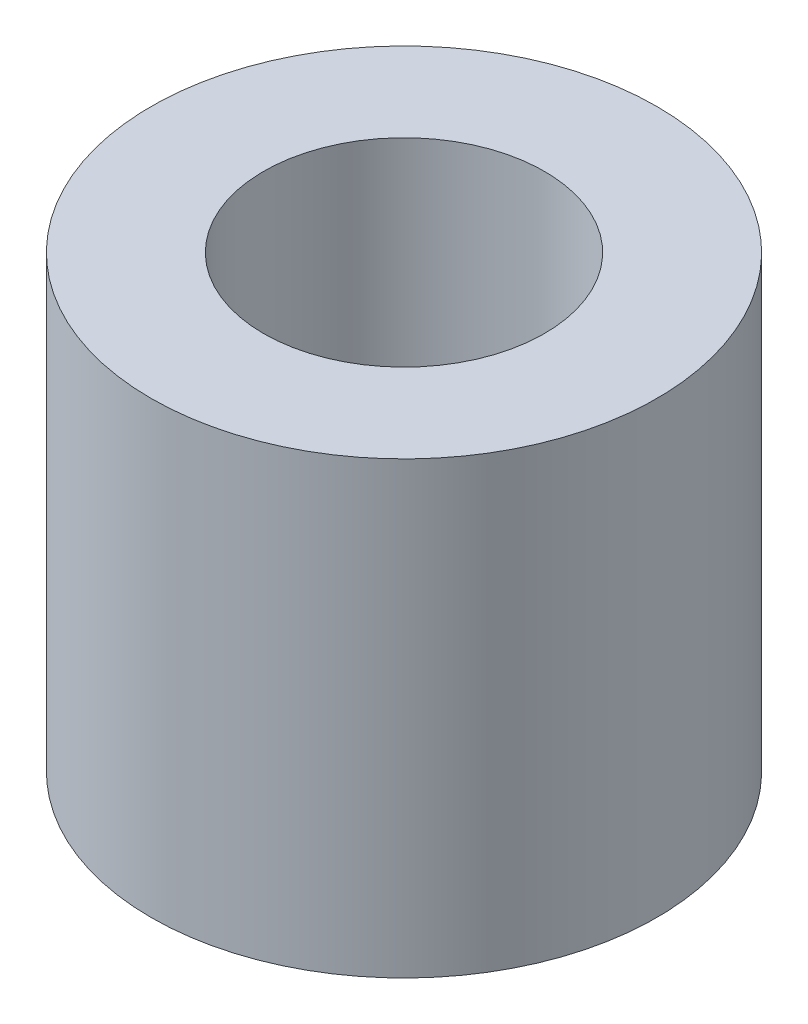
ISO-10303-21;
HEADER;
FILE_DESCRIPTION(('STEP AP214'),'2;1');
FILE_NAME('part.step','',(''),(''),'','','');
FILE_SCHEMA(('AUTOMOTIVE_DESIGN { 1 0 10303 214 1 1 1 1 }'));
ENDSEC;
DATA;
#1=APPLICATION_CONTEXT('core data for automotive mechanical design processes');
#2=APPLICATION_PROTOCOL_DEFINITION('international standard','automotive_design',2000,#1);
#3=PRODUCT_CONTEXT('',#1,'mechanical');
#4=PRODUCT('Part','Part','',(#3));
#5=PRODUCT_RELATED_PRODUCT_CATEGORY('part','',(#4));
#6=PRODUCT_DEFINITION_FORMATION('','',#4);
#7=PRODUCT_DEFINITION_CONTEXT('part definition',#1,'design');
#8=PRODUCT_DEFINITION('design','',#6,#7);
#9=PRODUCT_DEFINITION_SHAPE('','',#8);
#10=(LENGTH_UNIT() NAMED_UNIT(*) SI_UNIT(.MILLI.,.METRE.));
#11=(NAMED_UNIT(*) PLANE_ANGLE_UNIT() SI_UNIT($,.RADIAN.));
#12=(NAMED_UNIT(*) SI_UNIT($,.STERADIAN.) SOLID_ANGLE_UNIT());
#13=UNCERTAINTY_MEASURE_WITH_UNIT(LENGTH_MEASURE(1.E-05),#10,'distance_accuracy_value','');
#14=(GEOMETRIC_REPRESENTATION_CONTEXT(3) GLOBAL_UNCERTAINTY_ASSIGNED_CONTEXT((#13)) GLOBAL_UNIT_ASSIGNED_CONTEXT((#10,
#11,#12)) REPRESENTATION_CONTEXT('',''));
#15=CARTESIAN_POINT('',(0.,0.,0.));
#16=DIRECTION('',(0.,0.,1.));
#17=DIRECTION('',(1.,0.,0.));
#18=AXIS2_PLACEMENT_3D('',#15,#16,#17);
#19=CARTESIAN_POINT('',(0.,10.16,0.));
#20=DIRECTION('',(0.,1.,0.));
#21=DIRECTION('',(0.,0.,1.));
#22=AXIS2_PLACEMENT_3D('',#19,#20,#21);
#23=PLANE('',#22);
#24=CARTESIAN_POINT('',(0.,10.16,0.));
#25=DIRECTION('',(0.,1.,0.));
#26=DIRECTION('',(0.,0.,1.));
#27=AXIS2_PLACEMENT_3D('',#24,#25,#26);
#28=CIRCLE('',#27,5.715);
#29=CARTESIAN_POINT('',(0.,10.16,5.715));
#30=VERTEX_POINT('',#29);
#31=EDGE_CURVE('E10',#30,#30,#28,.T.);
#32=ORIENTED_EDGE('',*,*,#31,.T.);
#33=EDGE_LOOP('',(#32));
#34=FACE_BOUND('',#33,.T.);
#35=CARTESIAN_POINT('',(0.,10.16,0.));
#36=DIRECTION('',(0.,1.,0.));
#37=DIRECTION('',(0.,0.,1.));
#38=AXIS2_PLACEMENT_3D('',#35,#36,#37);
#39=CIRCLE('',#38,3.175);
#40=CARTESIAN_POINT('',(0.,10.16,3.175));
#41=VERTEX_POINT('',#40);
#42=EDGE_CURVE('E46',#41,#41,#39,.T.);
#43=ORIENTED_EDGE('',*,*,#42,.F.);
#44=EDGE_LOOP('',(#43));
#45=FACE_BOUND('',#44,.T.);
#46=ADVANCED_FACE('F35',(#34,#45),#23,.T.);
#47=CARTESIAN_POINT('',(0.,0.,0.));
#48=DIRECTION('',(0.,1.,0.));
#49=DIRECTION('',(0.,0.,1.));
#50=AXIS2_PLACEMENT_3D('',#47,#48,#49);
#51=PLANE('',#50);
#52=CARTESIAN_POINT('',(0.,0.,0.));
#53=DIRECTION('',(0.,1.,0.));
#54=DIRECTION('',(0.,0.,1.));
#55=AXIS2_PLACEMENT_3D('',#52,#53,#54);
#56=CIRCLE('',#55,5.715);
#57=CARTESIAN_POINT('',(0.,0.,5.715));
#58=VERTEX_POINT('',#57);
#59=EDGE_CURVE('E39',#58,#58,#56,.T.);
#60=ORIENTED_EDGE('',*,*,#59,.F.);
#61=EDGE_LOOP('',(#60));
#62=FACE_BOUND('',#61,.T.);
#63=CARTESIAN_POINT('',(0.,0.,0.));
#64=DIRECTION('',(0.,1.,0.));
#65=DIRECTION('',(0.,0.,1.));
#66=AXIS2_PLACEMENT_3D('',#63,#64,#65);
#67=CIRCLE('',#66,3.175);
#68=CARTESIAN_POINT('',(0.,0.,3.175));
#69=VERTEX_POINT('',#68);
#70=EDGE_CURVE('E48',#69,#69,#67,.T.);
#71=ORIENTED_EDGE('',*,*,#70,.T.);
#72=EDGE_LOOP('',(#71));
#73=FACE_BOUND('',#72,.T.);
#74=ADVANCED_FACE('F58',(#62,#73),#51,.F.);
#75=CARTESIAN_POINT('',(0.,10.16,0.));
#76=DIRECTION('',(0.,-1.,0.));
#77=DIRECTION('',(0.,0.,-1.));
#78=AXIS2_PLACEMENT_3D('',#75,#76,#77);
#79=CYLINDRICAL_SURFACE('',#78,5.715);
#80=ORIENTED_EDGE('',*,*,#31,.F.);
#81=EDGE_LOOP('',(#80));
#82=FACE_BOUND('',#81,.T.);
#83=ORIENTED_EDGE('',*,*,#59,.T.);
#84=EDGE_LOOP('',(#83));
#85=FACE_BOUND('',#84,.T.);
#86=ADVANCED_FACE('F37',(#82,#85),#79,.T.);
#87=CARTESIAN_POINT('',(0.,10.16,0.));
#88=DIRECTION('',(0.,-1.,0.));
#89=DIRECTION('',(0.,0.,-1.));
#90=AXIS2_PLACEMENT_3D('',#87,#88,#89);
#91=CYLINDRICAL_SURFACE('',#90,3.175);
#92=ORIENTED_EDGE('',*,*,#42,.T.);
#93=EDGE_LOOP('',(#92));
#94=FACE_BOUND('',#93,.T.);
#95=ORIENTED_EDGE('',*,*,#70,.F.);
#96=EDGE_LOOP('',(#95));
#97=FACE_BOUND('',#96,.T.);
#98=ADVANCED_FACE('F54',(#94,#97),#91,.F.);
#99=CLOSED_SHELL('',(#46,#74,#86,#98));
#100=MANIFOLD_SOLID_BREP('B2',#99);
#101=ADVANCED_BREP_SHAPE_REPRESENTATION('',(#18,#100),#14);
#102=SHAPE_DEFINITION_REPRESENTATION(#9,#101);
ENDSEC;
END-ISO-10303-21;
